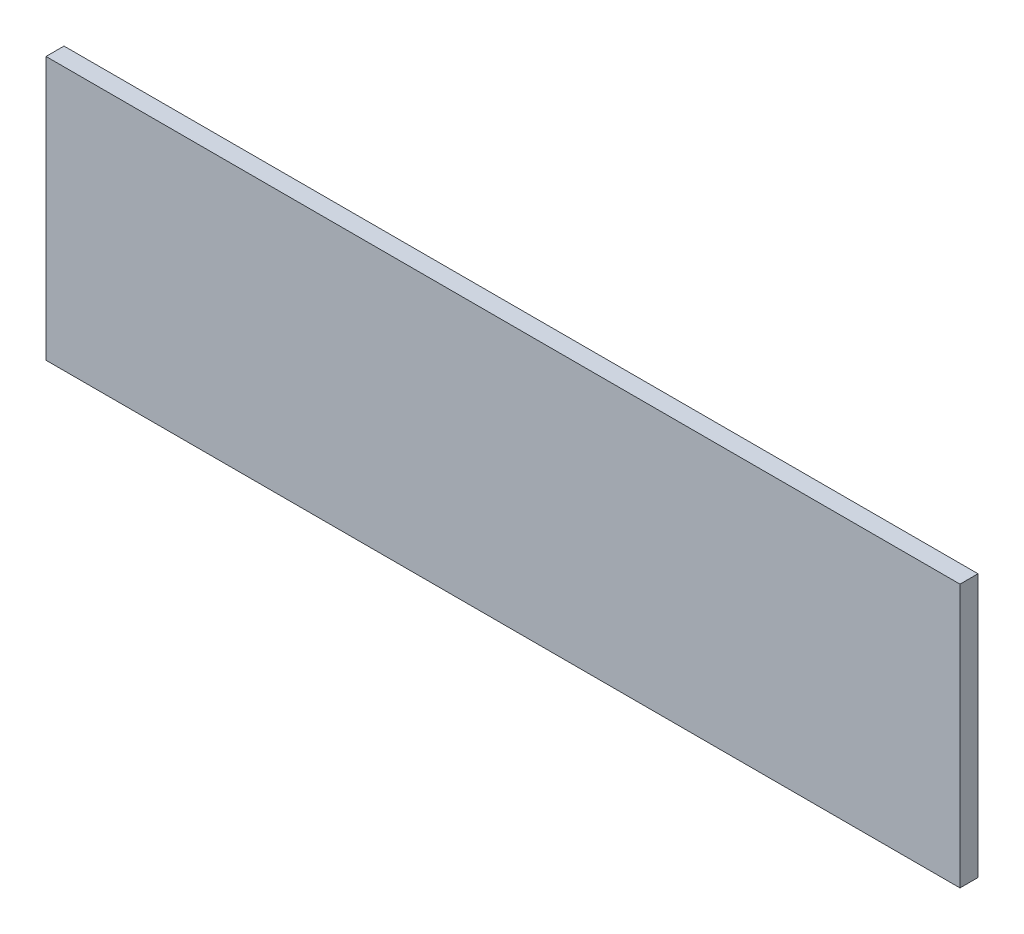
ISO-10303-21;
HEADER;
FILE_DESCRIPTION(('STEP AP214'),'2;1');
FILE_NAME('part.step','',(''),(''),'','','');
FILE_SCHEMA(('AUTOMOTIVE_DESIGN { 1 0 10303 214 1 1 1 1 }'));
ENDSEC;
DATA;
#1=APPLICATION_CONTEXT('core data for automotive mechanical design processes');
#2=APPLICATION_PROTOCOL_DEFINITION('international standard','automotive_design',2000,#1);
#3=PRODUCT_CONTEXT('',#1,'mechanical');
#4=PRODUCT('Part','Part','',(#3));
#5=PRODUCT_RELATED_PRODUCT_CATEGORY('part','',(#4));
#6=PRODUCT_DEFINITION_FORMATION('','',#4);
#7=PRODUCT_DEFINITION_CONTEXT('part definition',#1,'design');
#8=PRODUCT_DEFINITION('design','',#6,#7);
#9=PRODUCT_DEFINITION_SHAPE('','',#8);
#10=(LENGTH_UNIT() NAMED_UNIT(*) SI_UNIT(.MILLI.,.METRE.));
#11=(NAMED_UNIT(*) PLANE_ANGLE_UNIT() SI_UNIT($,.RADIAN.));
#12=(NAMED_UNIT(*) SI_UNIT($,.STERADIAN.) SOLID_ANGLE_UNIT());
#13=UNCERTAINTY_MEASURE_WITH_UNIT(LENGTH_MEASURE(1.E-05),#10,'distance_accuracy_value','');
#14=(GEOMETRIC_REPRESENTATION_CONTEXT(3) GLOBAL_UNCERTAINTY_ASSIGNED_CONTEXT((#13)) GLOBAL_UNIT_ASSIGNED_CONTEXT((#10,
#11,#12)) REPRESENTATION_CONTEXT('',''));
#15=CARTESIAN_POINT('',(0.,0.,0.));
#16=DIRECTION('',(0.,0.,1.));
#17=DIRECTION('',(1.,0.,0.));
#18=AXIS2_PLACEMENT_3D('',#15,#16,#17);
#19=CARTESIAN_POINT('',(0.,200.,6.5));
#20=DIRECTION('',(1.,0.,0.));
#21=DIRECTION('',(0.,0.,-1.));
#22=AXIS2_PLACEMENT_3D('',#19,#20,#21);
#23=PLANE('',#22);
#24=DIRECTION('',(0.,-1.,0.));
#25=VECTOR('',#24,1.);
#26=CARTESIAN_POINT('',(0.,200.,0.));
#27=LINE('',#26,#25);
#28=CARTESIAN_POINT('',(0.,200.,0.));
#29=VERTEX_POINT('',#28);
#30=CARTESIAN_POINT('',(0.,105.,0.));
#31=VERTEX_POINT('',#30);
#32=EDGE_CURVE('E96',#29,#31,#27,.T.);
#33=ORIENTED_EDGE('',*,*,#32,.T.);
#34=DIRECTION('',(0.,0.,-1.));
#35=VECTOR('',#34,1.);
#36=CARTESIAN_POINT('',(0.,105.,6.5));
#37=LINE('',#36,#35);
#38=CARTESIAN_POINT('',(0.,105.,6.5));
#39=VERTEX_POINT('',#38);
#40=EDGE_CURVE('E11',#39,#31,#37,.T.);
#41=ORIENTED_EDGE('',*,*,#40,.F.);
#42=DIRECTION('',(0.,-1.,0.));
#43=VECTOR('',#42,1.);
#44=CARTESIAN_POINT('',(0.,200.,6.5));
#45=LINE('',#44,#43);
#46=CARTESIAN_POINT('',(0.,200.,6.5));
#47=VERTEX_POINT('',#46);
#48=EDGE_CURVE('E84',#47,#39,#45,.T.);
#49=ORIENTED_EDGE('',*,*,#48,.F.);
#50=DIRECTION('',(0.,0.,-1.));
#51=VECTOR('',#50,1.);
#52=CARTESIAN_POINT('',(0.,200.,6.5));
#53=LINE('',#52,#51);
#54=EDGE_CURVE('E92',#47,#29,#53,.T.);
#55=ORIENTED_EDGE('',*,*,#54,.T.);
#56=EDGE_LOOP('',(#33,#41,#49,#55));
#57=FACE_BOUND('',#56,.T.);
#58=ADVANCED_FACE('F33',(#57),#23,.F.);
#59=CARTESIAN_POINT('',(0.,105.,6.5));
#60=DIRECTION('',(0.,1.,0.));
#61=DIRECTION('',(0.,0.,1.));
#62=AXIS2_PLACEMENT_3D('',#59,#60,#61);
#63=PLANE('',#62);
#64=DIRECTION('',(1.,0.,0.));
#65=VECTOR('',#64,1.);
#66=CARTESIAN_POINT('',(0.,105.,0.));
#67=LINE('',#66,#65);
#68=CARTESIAN_POINT('',(330.,105.,0.));
#69=VERTEX_POINT('',#68);
#70=EDGE_CURVE('E88',#31,#69,#67,.T.);
#71=ORIENTED_EDGE('',*,*,#70,.T.);
#72=DIRECTION('',(0.,0.,-1.));
#73=VECTOR('',#72,1.);
#74=CARTESIAN_POINT('',(330.,105.,6.5));
#75=LINE('',#74,#73);
#76=CARTESIAN_POINT('',(330.,105.,6.5));
#77=VERTEX_POINT('',#76);
#78=EDGE_CURVE('E41',#77,#69,#75,.T.);
#79=ORIENTED_EDGE('',*,*,#78,.F.);
#80=DIRECTION('',(1.,0.,0.));
#81=VECTOR('',#80,1.);
#82=CARTESIAN_POINT('',(0.,105.,6.5));
#83=LINE('',#82,#81);
#84=EDGE_CURVE('E79',#39,#77,#83,.T.);
#85=ORIENTED_EDGE('',*,*,#84,.F.);
#86=ORIENTED_EDGE('',*,*,#40,.T.);
#87=EDGE_LOOP('',(#71,#79,#85,#86));
#88=FACE_BOUND('',#87,.T.);
#89=ADVANCED_FACE('F87',(#88),#63,.F.);
#90=CARTESIAN_POINT('',(330.,200.,6.5));
#91=DIRECTION('',(-1.,0.,0.));
#92=DIRECTION('',(0.,0.,1.));
#93=AXIS2_PLACEMENT_3D('',#90,#91,#92);
#94=PLANE('',#93);
#95=DIRECTION('',(0.,1.,0.));
#96=VECTOR('',#95,1.);
#97=CARTESIAN_POINT('',(330.,200.,0.));
#98=LINE('',#97,#96);
#99=CARTESIAN_POINT('',(330.,200.,0.));
#100=VERTEX_POINT('',#99);
#101=EDGE_CURVE('E66',#69,#100,#98,.T.);
#102=ORIENTED_EDGE('',*,*,#101,.T.);
#103=DIRECTION('',(0.,0.,-1.));
#104=VECTOR('',#103,1.);
#105=CARTESIAN_POINT('',(330.,200.,6.5));
#106=LINE('',#105,#104);
#107=CARTESIAN_POINT('',(330.,200.,6.5));
#108=VERTEX_POINT('',#107);
#109=EDGE_CURVE('E89',#108,#100,#106,.T.);
#110=ORIENTED_EDGE('',*,*,#109,.F.);
#111=DIRECTION('',(0.,1.,0.));
#112=VECTOR('',#111,1.);
#113=CARTESIAN_POINT('',(330.,200.,6.5));
#114=LINE('',#113,#112);
#115=EDGE_CURVE('E82',#77,#108,#114,.T.);
#116=ORIENTED_EDGE('',*,*,#115,.F.);
#117=ORIENTED_EDGE('',*,*,#78,.T.);
#118=EDGE_LOOP('',(#102,#110,#116,#117));
#119=FACE_BOUND('',#118,.T.);
#120=ADVANCED_FACE('F90',(#119),#94,.F.);
#121=CARTESIAN_POINT('',(0.,200.,6.5));
#122=DIRECTION('',(0.,-1.,0.));
#123=DIRECTION('',(0.,0.,-1.));
#124=AXIS2_PLACEMENT_3D('',#121,#122,#123);
#125=PLANE('',#124);
#126=DIRECTION('',(-1.,0.,0.));
#127=VECTOR('',#126,1.);
#128=CARTESIAN_POINT('',(0.,200.,0.));
#129=LINE('',#128,#127);
#130=EDGE_CURVE('E72',#100,#29,#129,.T.);
#131=ORIENTED_EDGE('',*,*,#130,.T.);
#132=ORIENTED_EDGE('',*,*,#54,.F.);
#133=DIRECTION('',(-1.,0.,0.));
#134=VECTOR('',#133,1.);
#135=CARTESIAN_POINT('',(0.,200.,6.5));
#136=LINE('',#135,#134);
#137=EDGE_CURVE('E49',#108,#47,#136,.T.);
#138=ORIENTED_EDGE('',*,*,#137,.F.);
#139=ORIENTED_EDGE('',*,*,#109,.T.);
#140=EDGE_LOOP('',(#131,#132,#138,#139));
#141=FACE_BOUND('',#140,.T.);
#142=ADVANCED_FACE('F103',(#141),#125,.F.);
#143=CARTESIAN_POINT('',(0.,0.,6.5));
#144=DIRECTION('',(0.,0.,1.));
#145=DIRECTION('',(1.,0.,0.));
#146=AXIS2_PLACEMENT_3D('',#143,#144,#145);
#147=PLANE('',#146);
#148=ORIENTED_EDGE('',*,*,#48,.T.);
#149=ORIENTED_EDGE('',*,*,#84,.T.);
#150=ORIENTED_EDGE('',*,*,#115,.T.);
#151=ORIENTED_EDGE('',*,*,#137,.T.);
#152=EDGE_LOOP('',(#148,#149,#150,#151));
#153=FACE_BOUND('',#152,.T.);
#154=ADVANCED_FACE('F80',(#153),#147,.T.);
#155=CARTESIAN_POINT('',(0.,0.,0.));
#156=DIRECTION('',(0.,0.,1.));
#157=DIRECTION('',(1.,0.,0.));
#158=AXIS2_PLACEMENT_3D('',#155,#156,#157);
#159=PLANE('',#158);
#160=ORIENTED_EDGE('',*,*,#32,.F.);
#161=ORIENTED_EDGE('',*,*,#130,.F.);
#162=ORIENTED_EDGE('',*,*,#101,.F.);
#163=ORIENTED_EDGE('',*,*,#70,.F.);
#164=EDGE_LOOP('',(#160,#161,#162,#163));
#165=FACE_BOUND('',#164,.T.);
#166=ADVANCED_FACE('F106',(#165),#159,.F.);
#167=CLOSED_SHELL('',(#58,#89,#120,#142,#154,#166));
#168=MANIFOLD_SOLID_BREP('B2',#167);
#169=ADVANCED_BREP_SHAPE_REPRESENTATION('',(#18,#168),#14);
#170=SHAPE_DEFINITION_REPRESENTATION(#9,#169);
ENDSEC;
END-ISO-10303-21;
